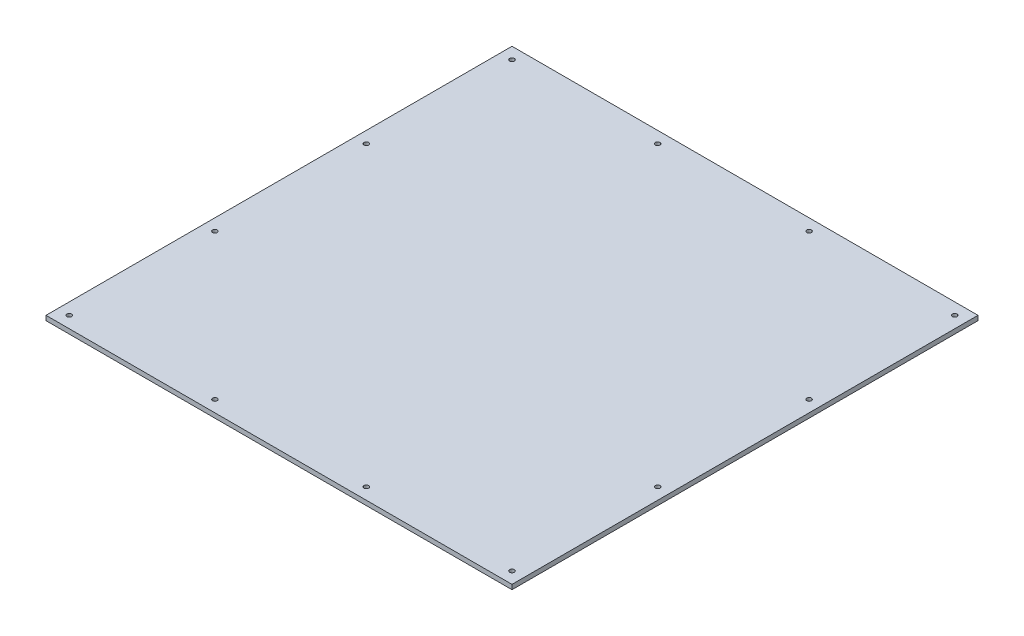
ISO-10303-21;
HEADER;
FILE_DESCRIPTION(('STEP AP214'),'2;1');
FILE_NAME('part.step','',(''),(''),'','','');
FILE_SCHEMA(('AUTOMOTIVE_DESIGN { 1 0 10303 214 1 1 1 1 }'));
ENDSEC;
DATA;
#1=APPLICATION_CONTEXT('core data for automotive mechanical design processes');
#2=APPLICATION_PROTOCOL_DEFINITION('international standard','automotive_design',2000,#1);
#3=PRODUCT_CONTEXT('',#1,'mechanical');
#4=PRODUCT('Part','Part','',(#3));
#5=PRODUCT_RELATED_PRODUCT_CATEGORY('part','',(#4));
#6=PRODUCT_DEFINITION_FORMATION('','',#4);
#7=PRODUCT_DEFINITION_CONTEXT('part definition',#1,'design');
#8=PRODUCT_DEFINITION('design','',#6,#7);
#9=PRODUCT_DEFINITION_SHAPE('','',#8);
#10=(LENGTH_UNIT() NAMED_UNIT(*) SI_UNIT(.MILLI.,.METRE.));
#11=(NAMED_UNIT(*) PLANE_ANGLE_UNIT() SI_UNIT($,.RADIAN.));
#12=(NAMED_UNIT(*) SI_UNIT($,.STERADIAN.) SOLID_ANGLE_UNIT());
#13=UNCERTAINTY_MEASURE_WITH_UNIT(LENGTH_MEASURE(1.E-05),#10,'distance_accuracy_value','');
#14=(GEOMETRIC_REPRESENTATION_CONTEXT(3) GLOBAL_UNCERTAINTY_ASSIGNED_CONTEXT((#13)) GLOBAL_UNIT_ASSIGNED_CONTEXT((#10,
#11,#12)) REPRESENTATION_CONTEXT('',''));
#15=CARTESIAN_POINT('',(0.,0.,0.));
#16=DIRECTION('',(0.,0.,1.));
#17=DIRECTION('',(1.,0.,0.));
#18=AXIS2_PLACEMENT_3D('',#15,#16,#17);
#19=CARTESIAN_POINT('',(0.,4.,0.));
#20=DIRECTION('',(0.,-1.,0.));
#21=DIRECTION('',(0.,0.,-1.));
#22=AXIS2_PLACEMENT_3D('',#19,#20,#21);
#23=PLANE('',#22);
#24=DIRECTION('',(0.,0.,-1.));
#25=VECTOR('',#24,1.);
#26=CARTESIAN_POINT('',(200.,4.,200.));
#27=LINE('',#26,#25);
#28=CARTESIAN_POINT('',(200.,4.,200.));
#29=VERTEX_POINT('',#28);
#30=CARTESIAN_POINT('',(200.,4.,-200.));
#31=VERTEX_POINT('',#30);
#32=EDGE_CURVE('E92',#29,#31,#27,.T.);
#33=ORIENTED_EDGE('',*,*,#32,.T.);
#34=DIRECTION('',(-1.,0.,0.));
#35=VECTOR('',#34,1.);
#36=CARTESIAN_POINT('',(-200.,4.,-200.));
#37=LINE('',#36,#35);
#38=CARTESIAN_POINT('',(-200.,4.,-200.));
#39=VERTEX_POINT('',#38);
#40=EDGE_CURVE('E87',#31,#39,#37,.T.);
#41=ORIENTED_EDGE('',*,*,#40,.T.);
#42=DIRECTION('',(0.,0.,1.));
#43=VECTOR('',#42,1.);
#44=CARTESIAN_POINT('',(-200.,4.,200.));
#45=LINE('',#44,#43);
#46=CARTESIAN_POINT('',(-200.,4.,200.));
#47=VERTEX_POINT('',#46);
#48=EDGE_CURVE('E90',#39,#47,#45,.T.);
#49=ORIENTED_EDGE('',*,*,#48,.T.);
#50=DIRECTION('',(1.,0.,0.));
#51=VECTOR('',#50,1.);
#52=CARTESIAN_POINT('',(-200.,4.,200.));
#53=LINE('',#52,#51);
#54=EDGE_CURVE('E57',#47,#29,#53,.T.);
#55=ORIENTED_EDGE('',*,*,#54,.T.);
#56=EDGE_LOOP('',(#33,#41,#49,#55));
#57=FACE_BOUND('',#56,.T.);
#58=CARTESIAN_POINT('',(-190.,4.,190.));
#59=DIRECTION('',(0.,1.,0.));
#60=DIRECTION('',(0.,0.,1.));
#61=AXIS2_PLACEMENT_3D('',#58,#59,#60);
#62=CIRCLE('',#61,2.);
#63=CARTESIAN_POINT('',(-190.,4.,192.));
#64=VERTEX_POINT('',#63);
#65=EDGE_CURVE('E112',#64,#64,#62,.T.);
#66=ORIENTED_EDGE('',*,*,#65,.F.);
#67=EDGE_LOOP('',(#66));
#68=FACE_BOUND('',#67,.T.);
#69=CARTESIAN_POINT('',(-64.9999999999999,4.,190.));
#70=DIRECTION('',(0.,1.,0.));
#71=DIRECTION('',(0.,0.,1.));
#72=AXIS2_PLACEMENT_3D('',#69,#70,#71);
#73=CIRCLE('',#72,2.);
#74=CARTESIAN_POINT('',(-64.9999999999999,4.,192.));
#75=VERTEX_POINT('',#74);
#76=EDGE_CURVE('E134',#75,#75,#73,.T.);
#77=ORIENTED_EDGE('',*,*,#76,.F.);
#78=EDGE_LOOP('',(#77));
#79=FACE_BOUND('',#78,.T.);
#80=CARTESIAN_POINT('',(65.0000000000001,4.,190.));
#81=DIRECTION('',(0.,1.,0.));
#82=DIRECTION('',(0.,0.,1.));
#83=AXIS2_PLACEMENT_3D('',#80,#81,#82);
#84=CIRCLE('',#83,2.);
#85=CARTESIAN_POINT('',(65.0000000000001,4.,192.));
#86=VERTEX_POINT('',#85);
#87=EDGE_CURVE('E142',#86,#86,#84,.T.);
#88=ORIENTED_EDGE('',*,*,#87,.F.);
#89=EDGE_LOOP('',(#88));
#90=FACE_BOUND('',#89,.T.);
#91=CARTESIAN_POINT('',(190.,4.,190.));
#92=DIRECTION('',(0.,1.,0.));
#93=DIRECTION('',(0.,0.,1.));
#94=AXIS2_PLACEMENT_3D('',#91,#92,#93);
#95=CIRCLE('',#94,2.);
#96=CARTESIAN_POINT('',(190.,4.,192.));
#97=VERTEX_POINT('',#96);
#98=EDGE_CURVE('E150',#97,#97,#95,.T.);
#99=ORIENTED_EDGE('',*,*,#98,.F.);
#100=EDGE_LOOP('',(#99));
#101=FACE_BOUND('',#100,.T.);
#102=CARTESIAN_POINT('',(-190.,4.,-190.));
#103=DIRECTION('',(0.,1.,0.));
#104=DIRECTION('',(0.,0.,-1.));
#105=AXIS2_PLACEMENT_3D('',#102,#103,#104);
#106=CIRCLE('',#105,2.);
#107=CARTESIAN_POINT('',(-190.,4.,-192.));
#108=VERTEX_POINT('',#107);
#109=EDGE_CURVE('E158',#108,#108,#106,.T.);
#110=ORIENTED_EDGE('',*,*,#109,.F.);
#111=EDGE_LOOP('',(#110));
#112=FACE_BOUND('',#111,.T.);
#113=CARTESIAN_POINT('',(-190.,4.,-64.9999999999999));
#114=DIRECTION('',(0.,1.,0.));
#115=DIRECTION('',(0.,0.,-1.));
#116=AXIS2_PLACEMENT_3D('',#113,#114,#115);
#117=CIRCLE('',#116,2.);
#118=CARTESIAN_POINT('',(-190.,4.,-66.9999999999999));
#119=VERTEX_POINT('',#118);
#120=EDGE_CURVE('E166',#119,#119,#117,.T.);
#121=ORIENTED_EDGE('',*,*,#120,.F.);
#122=EDGE_LOOP('',(#121));
#123=FACE_BOUND('',#122,.T.);
#124=CARTESIAN_POINT('',(-190.,4.,65.));
#125=DIRECTION('',(0.,1.,0.));
#126=DIRECTION('',(0.,0.,-1.));
#127=AXIS2_PLACEMENT_3D('',#124,#125,#126);
#128=CIRCLE('',#127,2.);
#129=CARTESIAN_POINT('',(-190.,4.,63.));
#130=VERTEX_POINT('',#129);
#131=EDGE_CURVE('E174',#130,#130,#128,.T.);
#132=ORIENTED_EDGE('',*,*,#131,.F.);
#133=EDGE_LOOP('',(#132));
#134=FACE_BOUND('',#133,.T.);
#135=CARTESIAN_POINT('',(190.,4.,-190.));
#136=DIRECTION('',(0.,1.,0.));
#137=DIRECTION('',(0.,0.,-1.));
#138=AXIS2_PLACEMENT_3D('',#135,#136,#137);
#139=CIRCLE('',#138,1.99999999999996);
#140=CARTESIAN_POINT('',(190.,4.,-192.));
#141=VERTEX_POINT('',#140);
#142=EDGE_CURVE('E182',#141,#141,#139,.T.);
#143=ORIENTED_EDGE('',*,*,#142,.F.);
#144=EDGE_LOOP('',(#143));
#145=FACE_BOUND('',#144,.T.);
#146=CARTESIAN_POINT('',(65.,4.,-190.));
#147=DIRECTION('',(0.,1.,0.));
#148=DIRECTION('',(0.,0.,1.));
#149=AXIS2_PLACEMENT_3D('',#146,#147,#148);
#150=CIRCLE('',#149,2.);
#151=CARTESIAN_POINT('',(65.,4.,-188.));
#152=VERTEX_POINT('',#151);
#153=EDGE_CURVE('E190',#152,#152,#150,.T.);
#154=ORIENTED_EDGE('',*,*,#153,.F.);
#155=EDGE_LOOP('',(#154));
#156=FACE_BOUND('',#155,.T.);
#157=CARTESIAN_POINT('',(-64.9999999999999,4.,-190.));
#158=DIRECTION('',(0.,1.,0.));
#159=DIRECTION('',(0.,0.,1.));
#160=AXIS2_PLACEMENT_3D('',#157,#158,#159);
#161=CIRCLE('',#160,2.);
#162=CARTESIAN_POINT('',(-64.9999999999999,4.,-188.));
#163=VERTEX_POINT('',#162);
#164=EDGE_CURVE('E198',#163,#163,#161,.T.);
#165=ORIENTED_EDGE('',*,*,#164,.F.);
#166=EDGE_LOOP('',(#165));
#167=FACE_BOUND('',#166,.T.);
#168=CARTESIAN_POINT('',(190.,4.,-64.9999999999999));
#169=DIRECTION('',(0.,1.,0.));
#170=DIRECTION('',(0.,0.,-1.));
#171=AXIS2_PLACEMENT_3D('',#168,#169,#170);
#172=CIRCLE('',#171,2.);
#173=CARTESIAN_POINT('',(190.,4.,-66.9999999999999));
#174=VERTEX_POINT('',#173);
#175=EDGE_CURVE('E206',#174,#174,#172,.T.);
#176=ORIENTED_EDGE('',*,*,#175,.F.);
#177=EDGE_LOOP('',(#176));
#178=FACE_BOUND('',#177,.T.);
#179=CARTESIAN_POINT('',(190.,4.,65.));
#180=DIRECTION('',(0.,1.,0.));
#181=DIRECTION('',(0.,0.,-1.));
#182=AXIS2_PLACEMENT_3D('',#179,#180,#181);
#183=CIRCLE('',#182,2.00000000000014);
#184=CARTESIAN_POINT('',(190.,4.,62.9999999999999));
#185=VERTEX_POINT('',#184);
#186=EDGE_CURVE('E214',#185,#185,#183,.T.);
#187=ORIENTED_EDGE('',*,*,#186,.F.);
#188=EDGE_LOOP('',(#187));
#189=FACE_BOUND('',#188,.T.);
#190=ADVANCED_FACE('F39',(#57,#68,#79,#90,#101,#112,#123,#134,#145,#156,#167,#178,#189),#23,.F.);
#191=CARTESIAN_POINT('',(0.,0.,0.));
#192=DIRECTION('',(0.,-1.,0.));
#193=DIRECTION('',(0.,0.,-1.));
#194=AXIS2_PLACEMENT_3D('',#191,#192,#193);
#195=PLANE('',#194);
#196=CARTESIAN_POINT('',(190.,0.,-64.9999999999999));
#197=DIRECTION('',(0.,1.,0.));
#198=DIRECTION('',(0.,0.,-1.));
#199=AXIS2_PLACEMENT_3D('',#196,#197,#198);
#200=CIRCLE('',#199,2.);
#201=CARTESIAN_POINT('',(190.,0.,-66.9999999999999));
#202=VERTEX_POINT('',#201);
#203=EDGE_CURVE('E210',#202,#202,#200,.T.);
#204=ORIENTED_EDGE('',*,*,#203,.T.);
#205=EDGE_LOOP('',(#204));
#206=FACE_BOUND('',#205,.T.);
#207=CARTESIAN_POINT('',(65.,0.,-190.));
#208=DIRECTION('',(0.,1.,0.));
#209=DIRECTION('',(0.,0.,1.));
#210=AXIS2_PLACEMENT_3D('',#207,#208,#209);
#211=CIRCLE('',#210,2.);
#212=CARTESIAN_POINT('',(65.,0.,-188.));
#213=VERTEX_POINT('',#212);
#214=EDGE_CURVE('E194',#213,#213,#211,.T.);
#215=ORIENTED_EDGE('',*,*,#214,.T.);
#216=EDGE_LOOP('',(#215));
#217=FACE_BOUND('',#216,.T.);
#218=CARTESIAN_POINT('',(-190.,0.,65.));
#219=DIRECTION('',(0.,1.,0.));
#220=DIRECTION('',(0.,0.,-1.));
#221=AXIS2_PLACEMENT_3D('',#218,#219,#220);
#222=CIRCLE('',#221,2.);
#223=CARTESIAN_POINT('',(-190.,0.,63.));
#224=VERTEX_POINT('',#223);
#225=EDGE_CURVE('E178',#224,#224,#222,.T.);
#226=ORIENTED_EDGE('',*,*,#225,.T.);
#227=EDGE_LOOP('',(#226));
#228=FACE_BOUND('',#227,.T.);
#229=CARTESIAN_POINT('',(-190.,0.,-190.));
#230=DIRECTION('',(0.,1.,0.));
#231=DIRECTION('',(0.,0.,-1.));
#232=AXIS2_PLACEMENT_3D('',#229,#230,#231);
#233=CIRCLE('',#232,2.);
#234=CARTESIAN_POINT('',(-190.,0.,-192.));
#235=VERTEX_POINT('',#234);
#236=EDGE_CURVE('E162',#235,#235,#233,.T.);
#237=ORIENTED_EDGE('',*,*,#236,.T.);
#238=EDGE_LOOP('',(#237));
#239=FACE_BOUND('',#238,.T.);
#240=CARTESIAN_POINT('',(65.0000000000001,0.,190.));
#241=DIRECTION('',(0.,1.,0.));
#242=DIRECTION('',(0.,0.,1.));
#243=AXIS2_PLACEMENT_3D('',#240,#241,#242);
#244=CIRCLE('',#243,2.);
#245=CARTESIAN_POINT('',(65.0000000000001,0.,192.));
#246=VERTEX_POINT('',#245);
#247=EDGE_CURVE('E146',#246,#246,#244,.T.);
#248=ORIENTED_EDGE('',*,*,#247,.T.);
#249=EDGE_LOOP('',(#248));
#250=FACE_BOUND('',#249,.T.);
#251=CARTESIAN_POINT('',(-190.,0.,190.));
#252=DIRECTION('',(0.,1.,0.));
#253=DIRECTION('',(0.,0.,1.));
#254=AXIS2_PLACEMENT_3D('',#251,#252,#253);
#255=CIRCLE('',#254,2.);
#256=CARTESIAN_POINT('',(-190.,0.,192.));
#257=VERTEX_POINT('',#256);
#258=EDGE_CURVE('E130',#257,#257,#255,.T.);
#259=ORIENTED_EDGE('',*,*,#258,.T.);
#260=EDGE_LOOP('',(#259));
#261=FACE_BOUND('',#260,.T.);
#262=DIRECTION('',(0.,0.,-1.));
#263=VECTOR('',#262,1.);
#264=CARTESIAN_POINT('',(200.,0.,200.));
#265=LINE('',#264,#263);
#266=CARTESIAN_POINT('',(200.,0.,200.));
#267=VERTEX_POINT('',#266);
#268=CARTESIAN_POINT('',(200.,0.,-200.));
#269=VERTEX_POINT('',#268);
#270=EDGE_CURVE('E108',#267,#269,#265,.T.);
#271=ORIENTED_EDGE('',*,*,#270,.F.);
#272=DIRECTION('',(1.,0.,0.));
#273=VECTOR('',#272,1.);
#274=CARTESIAN_POINT('',(-200.,0.,200.));
#275=LINE('',#274,#273);
#276=CARTESIAN_POINT('',(-200.,0.,200.));
#277=VERTEX_POINT('',#276);
#278=EDGE_CURVE('E80',#277,#267,#275,.T.);
#279=ORIENTED_EDGE('',*,*,#278,.F.);
#280=DIRECTION('',(0.,0.,1.));
#281=VECTOR('',#280,1.);
#282=CARTESIAN_POINT('',(-200.,0.,200.));
#283=LINE('',#282,#281);
#284=CARTESIAN_POINT('',(-200.,0.,-200.));
#285=VERTEX_POINT('',#284);
#286=EDGE_CURVE('E74',#285,#277,#283,.T.);
#287=ORIENTED_EDGE('',*,*,#286,.F.);
#288=DIRECTION('',(-1.,0.,0.));
#289=VECTOR('',#288,1.);
#290=CARTESIAN_POINT('',(-200.,0.,-200.));
#291=LINE('',#290,#289);
#292=EDGE_CURVE('E97',#269,#285,#291,.T.);
#293=ORIENTED_EDGE('',*,*,#292,.F.);
#294=EDGE_LOOP('',(#271,#279,#287,#293));
#295=FACE_BOUND('',#294,.T.);
#296=CARTESIAN_POINT('',(-64.9999999999999,0.,190.));
#297=DIRECTION('',(0.,1.,0.));
#298=DIRECTION('',(0.,0.,1.));
#299=AXIS2_PLACEMENT_3D('',#296,#297,#298);
#300=CIRCLE('',#299,2.);
#301=CARTESIAN_POINT('',(-64.9999999999999,0.,192.));
#302=VERTEX_POINT('',#301);
#303=EDGE_CURVE('E138',#302,#302,#300,.T.);
#304=ORIENTED_EDGE('',*,*,#303,.T.);
#305=EDGE_LOOP('',(#304));
#306=FACE_BOUND('',#305,.T.);
#307=CARTESIAN_POINT('',(190.,0.,190.));
#308=DIRECTION('',(0.,1.,0.));
#309=DIRECTION('',(0.,0.,1.));
#310=AXIS2_PLACEMENT_3D('',#307,#308,#309);
#311=CIRCLE('',#310,2.);
#312=CARTESIAN_POINT('',(190.,0.,192.));
#313=VERTEX_POINT('',#312);
#314=EDGE_CURVE('E154',#313,#313,#311,.T.);
#315=ORIENTED_EDGE('',*,*,#314,.T.);
#316=EDGE_LOOP('',(#315));
#317=FACE_BOUND('',#316,.T.);
#318=CARTESIAN_POINT('',(-190.,0.,-64.9999999999999));
#319=DIRECTION('',(0.,1.,0.));
#320=DIRECTION('',(0.,0.,-1.));
#321=AXIS2_PLACEMENT_3D('',#318,#319,#320);
#322=CIRCLE('',#321,2.);
#323=CARTESIAN_POINT('',(-190.,0.,-66.9999999999999));
#324=VERTEX_POINT('',#323);
#325=EDGE_CURVE('E170',#324,#324,#322,.T.);
#326=ORIENTED_EDGE('',*,*,#325,.T.);
#327=EDGE_LOOP('',(#326));
#328=FACE_BOUND('',#327,.T.);
#329=CARTESIAN_POINT('',(190.,0.,-190.));
#330=DIRECTION('',(0.,1.,0.));
#331=DIRECTION('',(0.,0.,-1.));
#332=AXIS2_PLACEMENT_3D('',#329,#330,#331);
#333=CIRCLE('',#332,1.99999999999996);
#334=CARTESIAN_POINT('',(190.,0.,-192.));
#335=VERTEX_POINT('',#334);
#336=EDGE_CURVE('E186',#335,#335,#333,.T.);
#337=ORIENTED_EDGE('',*,*,#336,.T.);
#338=EDGE_LOOP('',(#337));
#339=FACE_BOUND('',#338,.T.);
#340=CARTESIAN_POINT('',(-64.9999999999999,0.,-190.));
#341=DIRECTION('',(0.,1.,0.));
#342=DIRECTION('',(0.,0.,1.));
#343=AXIS2_PLACEMENT_3D('',#340,#341,#342);
#344=CIRCLE('',#343,2.);
#345=CARTESIAN_POINT('',(-64.9999999999999,0.,-188.));
#346=VERTEX_POINT('',#345);
#347=EDGE_CURVE('E202',#346,#346,#344,.T.);
#348=ORIENTED_EDGE('',*,*,#347,.T.);
#349=EDGE_LOOP('',(#348));
#350=FACE_BOUND('',#349,.T.);
#351=CARTESIAN_POINT('',(190.,0.,65.));
#352=DIRECTION('',(0.,1.,0.));
#353=DIRECTION('',(0.,0.,-1.));
#354=AXIS2_PLACEMENT_3D('',#351,#352,#353);
#355=CIRCLE('',#354,2.00000000000014);
#356=CARTESIAN_POINT('',(190.,0.,62.9999999999999));
#357=VERTEX_POINT('',#356);
#358=EDGE_CURVE('E218',#357,#357,#355,.T.);
#359=ORIENTED_EDGE('',*,*,#358,.T.);
#360=EDGE_LOOP('',(#359));
#361=FACE_BOUND('',#360,.T.);
#362=ADVANCED_FACE('F125',(#206,#217,#228,#239,#250,#261,#295,#306,#317,#328,#339,#350,#361),
#195,.T.);
#363=CARTESIAN_POINT('',(200.,4.,200.));
#364=DIRECTION('',(-1.,0.,0.));
#365=DIRECTION('',(0.,0.,1.));
#366=AXIS2_PLACEMENT_3D('',#363,#364,#365);
#367=PLANE('',#366);
#368=ORIENTED_EDGE('',*,*,#270,.T.);
#369=DIRECTION('',(0.,-1.,0.));
#370=VECTOR('',#369,1.);
#371=CARTESIAN_POINT('',(200.,4.,-200.));
#372=LINE('',#371,#370);
#373=EDGE_CURVE('E11',#31,#269,#372,.T.);
#374=ORIENTED_EDGE('',*,*,#373,.F.);
#375=ORIENTED_EDGE('',*,*,#32,.F.);
#376=DIRECTION('',(0.,-1.,0.));
#377=VECTOR('',#376,1.);
#378=CARTESIAN_POINT('',(200.,4.,200.));
#379=LINE('',#378,#377);
#380=EDGE_CURVE('E104',#29,#267,#379,.T.);
#381=ORIENTED_EDGE('',*,*,#380,.T.);
#382=EDGE_LOOP('',(#368,#374,#375,#381));
#383=FACE_BOUND('',#382,.T.);
#384=ADVANCED_FACE('F41',(#383),#367,.F.);
#385=CARTESIAN_POINT('',(-200.,4.,-200.));
#386=DIRECTION('',(0.,0.,1.));
#387=DIRECTION('',(1.,0.,0.));
#388=AXIS2_PLACEMENT_3D('',#385,#386,#387);
#389=PLANE('',#388);
#390=ORIENTED_EDGE('',*,*,#292,.T.);
#391=DIRECTION('',(0.,-1.,0.));
#392=VECTOR('',#391,1.);
#393=CARTESIAN_POINT('',(-200.,4.,-200.));
#394=LINE('',#393,#392);
#395=EDGE_CURVE('E49',#39,#285,#394,.T.);
#396=ORIENTED_EDGE('',*,*,#395,.F.);
#397=ORIENTED_EDGE('',*,*,#40,.F.);
#398=ORIENTED_EDGE('',*,*,#373,.T.);
#399=EDGE_LOOP('',(#390,#396,#397,#398));
#400=FACE_BOUND('',#399,.T.);
#401=ADVANCED_FACE('F96',(#400),#389,.F.);
#402=CARTESIAN_POINT('',(-200.,4.,200.));
#403=DIRECTION('',(1.,0.,0.));
#404=DIRECTION('',(0.,0.,-1.));
#405=AXIS2_PLACEMENT_3D('',#402,#403,#404);
#406=PLANE('',#405);
#407=ORIENTED_EDGE('',*,*,#286,.T.);
#408=DIRECTION('',(0.,-1.,0.));
#409=VECTOR('',#408,1.);
#410=CARTESIAN_POINT('',(-200.,4.,200.));
#411=LINE('',#410,#409);
#412=EDGE_CURVE('E99',#47,#277,#411,.T.);
#413=ORIENTED_EDGE('',*,*,#412,.F.);
#414=ORIENTED_EDGE('',*,*,#48,.F.);
#415=ORIENTED_EDGE('',*,*,#395,.T.);
#416=EDGE_LOOP('',(#407,#413,#414,#415));
#417=FACE_BOUND('',#416,.T.);
#418=ADVANCED_FACE('F100',(#417),#406,.F.);
#419=CARTESIAN_POINT('',(-200.,4.,200.));
#420=DIRECTION('',(0.,0.,-1.));
#421=DIRECTION('',(-1.,0.,0.));
#422=AXIS2_PLACEMENT_3D('',#419,#420,#421);
#423=PLANE('',#422);
#424=ORIENTED_EDGE('',*,*,#278,.T.);
#425=ORIENTED_EDGE('',*,*,#380,.F.);
#426=ORIENTED_EDGE('',*,*,#54,.F.);
#427=ORIENTED_EDGE('',*,*,#412,.T.);
#428=EDGE_LOOP('',(#424,#425,#426,#427));
#429=FACE_BOUND('',#428,.T.);
#430=ADVANCED_FACE('F122',(#429),#423,.F.);
#431=CARTESIAN_POINT('',(-190.,4.,190.));
#432=DIRECTION('',(0.,-1.,0.));
#433=DIRECTION('',(0.,0.,-1.));
#434=AXIS2_PLACEMENT_3D('',#431,#432,#433);
#435=CYLINDRICAL_SURFACE('',#434,2.);
#436=ORIENTED_EDGE('',*,*,#65,.T.);
#437=EDGE_LOOP('',(#436));
#438=FACE_BOUND('',#437,.T.);
#439=ORIENTED_EDGE('',*,*,#258,.F.);
#440=EDGE_LOOP('',(#439));
#441=FACE_BOUND('',#440,.T.);
#442=ADVANCED_FACE('F237',(#438,#441),#435,.F.);
#443=CARTESIAN_POINT('',(-64.9999999999999,4.,190.));
#444=DIRECTION('',(0.,-1.,0.));
#445=DIRECTION('',(0.,0.,-1.));
#446=AXIS2_PLACEMENT_3D('',#443,#444,#445);
#447=CYLINDRICAL_SURFACE('',#446,2.);
#448=ORIENTED_EDGE('',*,*,#76,.T.);
#449=EDGE_LOOP('',(#448));
#450=FACE_BOUND('',#449,.T.);
#451=ORIENTED_EDGE('',*,*,#303,.F.);
#452=EDGE_LOOP('',(#451));
#453=FACE_BOUND('',#452,.T.);
#454=ADVANCED_FACE('F283',(#450,#453),#447,.F.);
#455=CARTESIAN_POINT('',(65.0000000000001,4.,190.));
#456=DIRECTION('',(0.,-1.,0.));
#457=DIRECTION('',(0.,0.,-1.));
#458=AXIS2_PLACEMENT_3D('',#455,#456,#457);
#459=CYLINDRICAL_SURFACE('',#458,2.);
#460=ORIENTED_EDGE('',*,*,#87,.T.);
#461=EDGE_LOOP('',(#460));
#462=FACE_BOUND('',#461,.T.);
#463=ORIENTED_EDGE('',*,*,#247,.F.);
#464=EDGE_LOOP('',(#463));
#465=FACE_BOUND('',#464,.T.);
#466=ADVANCED_FACE('F291',(#462,#465),#459,.F.);
#467=CARTESIAN_POINT('',(190.,4.,190.));
#468=DIRECTION('',(0.,-1.,0.));
#469=DIRECTION('',(0.,0.,-1.));
#470=AXIS2_PLACEMENT_3D('',#467,#468,#469);
#471=CYLINDRICAL_SURFACE('',#470,2.);
#472=ORIENTED_EDGE('',*,*,#98,.T.);
#473=EDGE_LOOP('',(#472));
#474=FACE_BOUND('',#473,.T.);
#475=ORIENTED_EDGE('',*,*,#314,.F.);
#476=EDGE_LOOP('',(#475));
#477=FACE_BOUND('',#476,.T.);
#478=ADVANCED_FACE('F299',(#474,#477),#471,.F.);
#479=CARTESIAN_POINT('',(-190.,4.,-190.));
#480=DIRECTION('',(0.,-1.,0.));
#481=DIRECTION('',(0.,0.,-1.));
#482=AXIS2_PLACEMENT_3D('',#479,#480,#481);
#483=CYLINDRICAL_SURFACE('',#482,2.);
#484=ORIENTED_EDGE('',*,*,#109,.T.);
#485=EDGE_LOOP('',(#484));
#486=FACE_BOUND('',#485,.T.);
#487=ORIENTED_EDGE('',*,*,#236,.F.);
#488=EDGE_LOOP('',(#487));
#489=FACE_BOUND('',#488,.T.);
#490=ADVANCED_FACE('F308',(#486,#489),#483,.F.);
#491=CARTESIAN_POINT('',(-190.,4.,-64.9999999999999));
#492=DIRECTION('',(0.,-1.,0.));
#493=DIRECTION('',(0.,0.,-1.));
#494=AXIS2_PLACEMENT_3D('',#491,#492,#493);
#495=CYLINDRICAL_SURFACE('',#494,2.);
#496=ORIENTED_EDGE('',*,*,#120,.T.);
#497=EDGE_LOOP('',(#496));
#498=FACE_BOUND('',#497,.T.);
#499=ORIENTED_EDGE('',*,*,#325,.F.);
#500=EDGE_LOOP('',(#499));
#501=FACE_BOUND('',#500,.T.);
#502=ADVANCED_FACE('F317',(#498,#501),#495,.F.);
#503=CARTESIAN_POINT('',(-190.,4.,65.));
#504=DIRECTION('',(0.,-1.,0.));
#505=DIRECTION('',(0.,0.,-1.));
#506=AXIS2_PLACEMENT_3D('',#503,#504,#505);
#507=CYLINDRICAL_SURFACE('',#506,2.);
#508=ORIENTED_EDGE('',*,*,#131,.T.);
#509=EDGE_LOOP('',(#508));
#510=FACE_BOUND('',#509,.T.);
#511=ORIENTED_EDGE('',*,*,#225,.F.);
#512=EDGE_LOOP('',(#511));
#513=FACE_BOUND('',#512,.T.);
#514=ADVANCED_FACE('F326',(#510,#513),#507,.F.);
#515=CARTESIAN_POINT('',(190.,4.,-190.));
#516=DIRECTION('',(0.,-1.,0.));
#517=DIRECTION('',(0.,0.,-1.));
#518=AXIS2_PLACEMENT_3D('',#515,#516,#517);
#519=CYLINDRICAL_SURFACE('',#518,1.99999999999996);
#520=ORIENTED_EDGE('',*,*,#142,.T.);
#521=EDGE_LOOP('',(#520));
#522=FACE_BOUND('',#521,.T.);
#523=ORIENTED_EDGE('',*,*,#336,.F.);
#524=EDGE_LOOP('',(#523));
#525=FACE_BOUND('',#524,.T.);
#526=ADVANCED_FACE('F335',(#522,#525),#519,.F.);
#527=CARTESIAN_POINT('',(65.,4.,-190.));
#528=DIRECTION('',(0.,-1.,0.));
#529=DIRECTION('',(0.,0.,-1.));
#530=AXIS2_PLACEMENT_3D('',#527,#528,#529);
#531=CYLINDRICAL_SURFACE('',#530,2.);
#532=ORIENTED_EDGE('',*,*,#153,.T.);
#533=EDGE_LOOP('',(#532));
#534=FACE_BOUND('',#533,.T.);
#535=ORIENTED_EDGE('',*,*,#214,.F.);
#536=EDGE_LOOP('',(#535));
#537=FACE_BOUND('',#536,.T.);
#538=ADVANCED_FACE('F344',(#534,#537),#531,.F.);
#539=CARTESIAN_POINT('',(-64.9999999999999,4.,-190.));
#540=DIRECTION('',(0.,-1.,0.));
#541=DIRECTION('',(0.,0.,-1.));
#542=AXIS2_PLACEMENT_3D('',#539,#540,#541);
#543=CYLINDRICAL_SURFACE('',#542,2.);
#544=ORIENTED_EDGE('',*,*,#164,.T.);
#545=EDGE_LOOP('',(#544));
#546=FACE_BOUND('',#545,.T.);
#547=ORIENTED_EDGE('',*,*,#347,.F.);
#548=EDGE_LOOP('',(#547));
#549=FACE_BOUND('',#548,.T.);
#550=ADVANCED_FACE('F353',(#546,#549),#543,.F.);
#551=CARTESIAN_POINT('',(190.,4.,-64.9999999999999));
#552=DIRECTION('',(0.,-1.,0.));
#553=DIRECTION('',(0.,0.,-1.));
#554=AXIS2_PLACEMENT_3D('',#551,#552,#553);
#555=CYLINDRICAL_SURFACE('',#554,2.);
#556=ORIENTED_EDGE('',*,*,#175,.T.);
#557=EDGE_LOOP('',(#556));
#558=FACE_BOUND('',#557,.T.);
#559=ORIENTED_EDGE('',*,*,#203,.F.);
#560=EDGE_LOOP('',(#559));
#561=FACE_BOUND('',#560,.T.);
#562=ADVANCED_FACE('F362',(#558,#561),#555,.F.);
#563=CARTESIAN_POINT('',(190.,4.,65.));
#564=DIRECTION('',(0.,-1.,0.));
#565=DIRECTION('',(0.,0.,-1.));
#566=AXIS2_PLACEMENT_3D('',#563,#564,#565);
#567=CYLINDRICAL_SURFACE('',#566,2.00000000000014);
#568=ORIENTED_EDGE('',*,*,#186,.T.);
#569=EDGE_LOOP('',(#568));
#570=FACE_BOUND('',#569,.T.);
#571=ORIENTED_EDGE('',*,*,#358,.F.);
#572=EDGE_LOOP('',(#571));
#573=FACE_BOUND('',#572,.T.);
#574=ADVANCED_FACE('F226',(#570,#573),#567,.F.);
#575=CLOSED_SHELL('',(#190,#362,#384,#401,#418,#430,#442,#454,#466,#478,#490,#502,#514,#526,
#538,#550,#562,#574));
#576=MANIFOLD_SOLID_BREP('B2',#575);
#577=ADVANCED_BREP_SHAPE_REPRESENTATION('',(#18,#576),#14);
#578=SHAPE_DEFINITION_REPRESENTATION(#9,#577);
ENDSEC;
END-ISO-10303-21;
